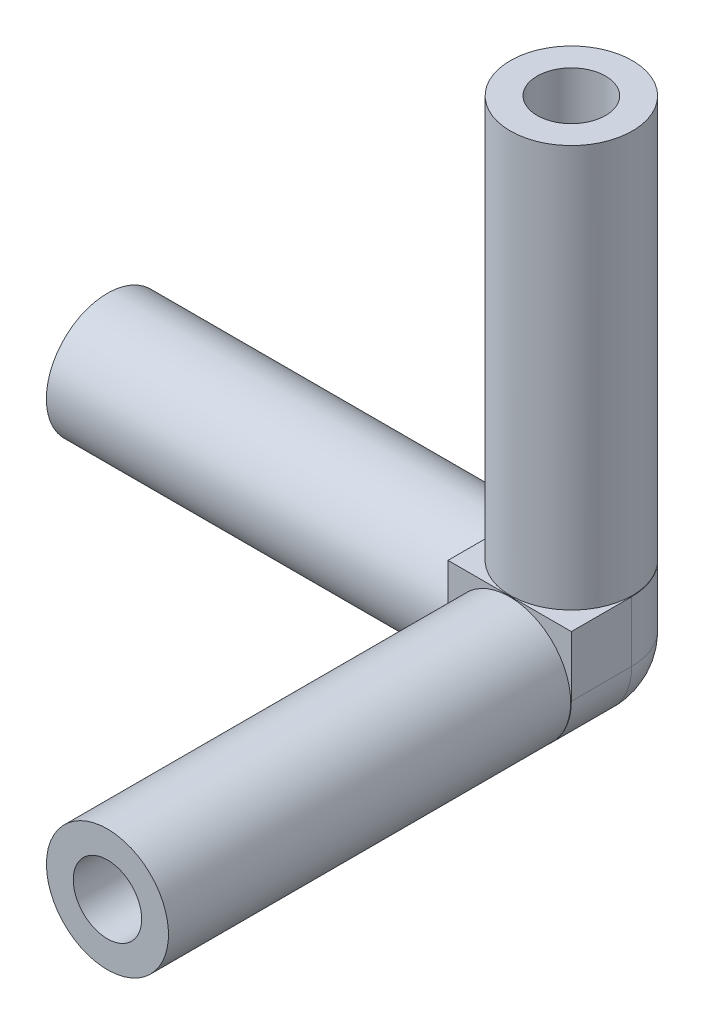
ISO-10303-21;
HEADER;
FILE_DESCRIPTION(('STEP AP214'),'2;1');
FILE_NAME('part.step','',(''),(''),'','','');
FILE_SCHEMA(('AUTOMOTIVE_DESIGN { 1 0 10303 214 1 1 1 1 }'));
ENDSEC;
DATA;
#1=APPLICATION_CONTEXT('core data for automotive mechanical design processes');
#2=APPLICATION_PROTOCOL_DEFINITION('international standard','automotive_design',2000,#1);
#3=PRODUCT_CONTEXT('',#1,'mechanical');
#4=PRODUCT('Part','Part','',(#3));
#5=PRODUCT_RELATED_PRODUCT_CATEGORY('part','',(#4));
#6=PRODUCT_DEFINITION_FORMATION('','',#4);
#7=PRODUCT_DEFINITION_CONTEXT('part definition',#1,'design');
#8=PRODUCT_DEFINITION('design','',#6,#7);
#9=PRODUCT_DEFINITION_SHAPE('','',#8);
#10=(LENGTH_UNIT() NAMED_UNIT(*) SI_UNIT(.MILLI.,.METRE.));
#11=(NAMED_UNIT(*) PLANE_ANGLE_UNIT() SI_UNIT($,.RADIAN.));
#12=(NAMED_UNIT(*) SI_UNIT($,.STERADIAN.) SOLID_ANGLE_UNIT());
#13=UNCERTAINTY_MEASURE_WITH_UNIT(LENGTH_MEASURE(1.E-05),#10,'distance_accuracy_value','');
#14=(GEOMETRIC_REPRESENTATION_CONTEXT(3) GLOBAL_UNCERTAINTY_ASSIGNED_CONTEXT((#13)) GLOBAL_UNIT_ASSIGNED_CONTEXT((#10,
#11,#12)) REPRESENTATION_CONTEXT('',''));
#15=CARTESIAN_POINT('',(0.,0.,0.));
#16=DIRECTION('',(0.,0.,1.));
#17=DIRECTION('',(1.,0.,0.));
#18=AXIS2_PLACEMENT_3D('',#15,#16,#17);
#19=CARTESIAN_POINT('',(140.733042235892,-0.400000000000003,-27.3342708358502));
#20=DIRECTION('',(-1.,0.,0.));
#21=DIRECTION('',(0.,0.,1.));
#22=AXIS2_PLACEMENT_3D('',#19,#20,#21);
#23=PLANE('',#22);
#24=CARTESIAN_POINT('',(140.733042235892,-4.4,-31.3342708358502));
#25=DIRECTION('',(-1.,0.,0.));
#26=DIRECTION('',(0.,0.,1.));
#27=AXIS2_PLACEMENT_3D('',#24,#25,#26);
#28=CIRCLE('',#27,2.55);
#29=CARTESIAN_POINT('',(140.733042235892,-4.4,-28.7842708358502));
#30=VERTEX_POINT('',#29);
#31=EDGE_CURVE('E13',#30,#30,#28,.T.);
#32=ORIENTED_EDGE('',*,*,#31,.T.);
#33=EDGE_LOOP('',(#32));
#34=FACE_BOUND('',#33,.T.);
#35=CARTESIAN_POINT('',(140.733042235892,-4.4,-31.3342708358502));
#36=DIRECTION('',(-1.,0.,0.));
#37=DIRECTION('',(0.,0.,1.));
#38=AXIS2_PLACEMENT_3D('',#35,#36,#37);
#39=CIRCLE('',#38,4.55);
#40=CARTESIAN_POINT('',(140.733042235892,-4.4,-26.7842708358502));
#41=VERTEX_POINT('',#40);
#42=EDGE_CURVE('E80',#41,#41,#39,.T.);
#43=ORIENTED_EDGE('',*,*,#42,.F.);
#44=EDGE_LOOP('',(#43));
#45=FACE_BOUND('',#44,.T.);
#46=ADVANCED_FACE('F65',(#34,#45),#23,.F.);
#47=CARTESIAN_POINT('',(110.733042235892,-4.4,-31.33427083585));
#48=DIRECTION('',(-1.,0.,0.));
#49=DIRECTION('',(0.,0.,1.));
#50=AXIS2_PLACEMENT_3D('',#47,#48,#49);
#51=PLANE('',#50);
#52=CARTESIAN_POINT('',(110.733042235892,-4.4,-31.33427083585));
#53=DIRECTION('',(-1.,0.,0.));
#54=DIRECTION('',(0.,0.,1.));
#55=AXIS2_PLACEMENT_3D('',#52,#53,#54);
#56=CIRCLE('',#55,4.55);
#57=CARTESIAN_POINT('',(110.733042235892,-4.4,-26.78427083585));
#58=VERTEX_POINT('',#57);
#59=EDGE_CURVE('E69',#58,#58,#56,.T.);
#60=ORIENTED_EDGE('',*,*,#59,.T.);
#61=EDGE_LOOP('',(#60));
#62=FACE_BOUND('',#61,.T.);
#63=CARTESIAN_POINT('',(110.733042235892,-4.4,-31.33427083585));
#64=DIRECTION('',(-1.,0.,0.));
#65=DIRECTION('',(0.,0.,1.));
#66=AXIS2_PLACEMENT_3D('',#63,#64,#65);
#67=CIRCLE('',#66,2.55);
#68=CARTESIAN_POINT('',(110.733042235892,-4.4,-28.78427083585));
#69=VERTEX_POINT('',#68);
#70=EDGE_CURVE('E74',#69,#69,#67,.T.);
#71=ORIENTED_EDGE('',*,*,#70,.F.);
#72=EDGE_LOOP('',(#71));
#73=FACE_BOUND('',#72,.T.);
#74=ADVANCED_FACE('F90',(#62,#73),#51,.T.);
#75=CARTESIAN_POINT('',(110.733042235892,-4.4,-31.33427083585));
#76=DIRECTION('',(1.,0.,0.));
#77=DIRECTION('',(0.,0.,-1.));
#78=AXIS2_PLACEMENT_3D('',#75,#76,#77);
#79=CYLINDRICAL_SURFACE('',#78,4.55);
#80=ORIENTED_EDGE('',*,*,#42,.T.);
#81=EDGE_LOOP('',(#80));
#82=FACE_BOUND('',#81,.T.);
#83=ORIENTED_EDGE('',*,*,#59,.F.);
#84=EDGE_LOOP('',(#83));
#85=FACE_BOUND('',#84,.T.);
#86=ADVANCED_FACE('F67',(#82,#85),#79,.T.);
#87=CARTESIAN_POINT('',(110.733042235892,-4.4,-31.33427083585));
#88=DIRECTION('',(1.,0.,0.));
#89=DIRECTION('',(0.,0.,-1.));
#90=AXIS2_PLACEMENT_3D('',#87,#88,#89);
#91=CYLINDRICAL_SURFACE('',#90,2.55);
#92=ORIENTED_EDGE('',*,*,#70,.T.);
#93=EDGE_LOOP('',(#92));
#94=FACE_BOUND('',#93,.T.);
#95=ORIENTED_EDGE('',*,*,#31,.F.);
#96=EDGE_LOOP('',(#95));
#97=FACE_BOUND('',#96,.T.);
#98=ADVANCED_FACE('F94',(#94,#97),#91,.F.);
#99=CLOSED_SHELL('',(#46,#74,#86,#98));
#100=MANIFOLD_SOLID_BREP('B2',#99);
#101=CARTESIAN_POINT('',(145.334550212783,30.203044431272,-31.3357331577452));
#102=DIRECTION('',(0.,-1.,4.60985232837495E-13));
#103=DIRECTION('',(0.,-4.60985232837495E-13,-1.));
#104=AXIS2_PLACEMENT_3D('',#101,#102,#103);
#105=CYLINDRICAL_SURFACE('',#104,4.55);
#106=CARTESIAN_POINT('',(145.334550212783,30.203044431272,-31.3357331577452));
#107=DIRECTION('',(0.,1.,-4.60985232837495E-13));
#108=DIRECTION('',(0.,4.60985232837495E-13,1.));
#109=AXIS2_PLACEMENT_3D('',#106,#107,#108);
#110=CIRCLE('',#109,4.55);
#111=CARTESIAN_POINT('',(145.334550212783,30.2030444312741,-26.7857331577452));
#112=VERTEX_POINT('',#111);
#113=EDGE_CURVE('E189',#112,#112,#110,.T.);
#114=ORIENTED_EDGE('',*,*,#113,.F.);
#115=EDGE_LOOP('',(#114));
#116=FACE_BOUND('',#115,.T.);
#117=CARTESIAN_POINT('',(145.334550212783,0.204443389159776,-31.3357331577314));
#118=DIRECTION('',(0.,1.,0.));
#119=DIRECTION('',(0.,0.,1.));
#120=AXIS2_PLACEMENT_3D('',#117,#118,#119);
#121=CIRCLE('',#120,4.55);
#122=CARTESIAN_POINT('',(145.452700054024,0.204443389159776,-26.7872674147566));
#123=VERTEX_POINT('',#122);
#124=CARTESIAN_POINT('',(149.884550206818,0.204443389159776,-31.3355001625663));
#125=VERTEX_POINT('',#124);
#126=EDGE_CURVE('E184',#123,#125,#121,.T.);
#127=ORIENTED_EDGE('',*,*,#126,.T.);
#128=CARTESIAN_POINT('',(145.334550212783,0.204443389159776,-31.3357331577314));
#129=DIRECTION('',(0.,1.,0.));
#130=DIRECTION('',(0.,0.,1.));
#131=AXIS2_PLACEMENT_3D('',#128,#129,#130);
#132=CIRCLE('',#131,4.55);
#133=CARTESIAN_POINT('',(145.457571658612,0.204443389159776,-35.8840697464049));
#134=VERTEX_POINT('',#133);
#135=EDGE_CURVE('E152',#125,#134,#132,.T.);
#136=ORIENTED_EDGE('',*,*,#135,.T.);
#137=CARTESIAN_POINT('',(145.334550212783,0.204443389159776,-31.3357331577314));
#138=DIRECTION('',(0.,1.,0.));
#139=DIRECTION('',(0.,0.,1.));
#140=AXIS2_PLACEMENT_3D('',#137,#138,#139);
#141=CIRCLE('',#140,4.55);
#142=CARTESIAN_POINT('',(145.210578277765,0.204443389159776,-35.8840439385958));
#143=VERTEX_POINT('',#142);
#144=EDGE_CURVE('E179',#134,#143,#141,.T.);
#145=ORIENTED_EDGE('',*,*,#144,.T.);
#146=CARTESIAN_POINT('',(145.334550212783,0.204443389159776,-31.3357331577314));
#147=DIRECTION('',(0.,1.,0.));
#148=DIRECTION('',(0.,0.,1.));
#149=AXIS2_PLACEMENT_3D('',#146,#147,#148);
#150=CIRCLE('',#149,4.55);
#151=CARTESIAN_POINT('',(140.78455031134,0.204443389159776,-31.3347861287464));
#152=VERTEX_POINT('',#151);
#153=EDGE_CURVE('E197',#143,#152,#150,.T.);
#154=ORIENTED_EDGE('',*,*,#153,.T.);
#155=CARTESIAN_POINT('',(145.334550212783,0.204443389159776,-31.3357331577314));
#156=DIRECTION('',(0.,1.,0.));
#157=DIRECTION('',(0.,0.,1.));
#158=AXIS2_PLACEMENT_3D('',#155,#156,#157);
#159=CIRCLE('',#158,4.55);
#160=CARTESIAN_POINT('',(145.212136715868,0.204443389159776,-26.787380166178));
#161=VERTEX_POINT('',#160);
#162=EDGE_CURVE('E192',#152,#161,#159,.T.);
#163=ORIENTED_EDGE('',*,*,#162,.T.);
#164=CARTESIAN_POINT('',(145.334550212783,0.204443389159776,-31.3357331577314));
#165=DIRECTION('',(0.,1.,0.));
#166=DIRECTION('',(0.,0.,1.));
#167=AXIS2_PLACEMENT_3D('',#164,#165,#166);
#168=CIRCLE('',#167,4.55);
#169=CARTESIAN_POINT('',(145.332414123907,0.204443389159776,-26.7857336591463));
#170=VERTEX_POINT('',#169);
#171=EDGE_CURVE('E158',#170,#161,#168,.F.);
#172=ORIENTED_EDGE('',*,*,#171,.F.);
#173=CARTESIAN_POINT('',(145.334550212783,0.204443389159776,-31.3357331577314));
#174=DIRECTION('',(0.,1.,0.));
#175=DIRECTION('',(0.,0.,1.));
#176=AXIS2_PLACEMENT_3D('',#173,#174,#175);
#177=CIRCLE('',#176,4.55);
#178=EDGE_CURVE('E186',#123,#170,#177,.F.);
#179=ORIENTED_EDGE('',*,*,#178,.F.);
#180=EDGE_LOOP('',(#127,#136,#145,#154,#163,#172,#179));
#181=FACE_BOUND('',#180,.T.);
#182=ADVANCED_FACE('F149',(#116,#181),#105,.T.);
#183=CARTESIAN_POINT('',(145.334550212783,30.203044431272,-31.3357331577452));
#184=DIRECTION('',(0.,1.,-4.60985232837495E-13));
#185=DIRECTION('',(0.,4.60985232837495E-13,1.));
#186=AXIS2_PLACEMENT_3D('',#183,#184,#185);
#187=PLANE('',#186);
#188=ORIENTED_EDGE('',*,*,#113,.T.);
#189=EDGE_LOOP('',(#188));
#190=FACE_BOUND('',#189,.T.);
#191=CARTESIAN_POINT('',(145.334550212783,30.203044431272,-31.3357331577452));
#192=DIRECTION('',(0.,1.,-4.60985232837495E-13));
#193=DIRECTION('',(0.,4.60985232837495E-13,1.));
#194=AXIS2_PLACEMENT_3D('',#191,#192,#193);
#195=CIRCLE('',#194,2.55);
#196=CARTESIAN_POINT('',(145.334550212783,30.2030444312732,-28.7857331577452));
#197=VERTEX_POINT('',#196);
#198=EDGE_CURVE('E198',#197,#197,#195,.T.);
#199=ORIENTED_EDGE('',*,*,#198,.F.);
#200=EDGE_LOOP('',(#199));
#201=FACE_BOUND('',#200,.T.);
#202=ADVANCED_FACE('F207',(#190,#201),#187,.T.);
#203=CARTESIAN_POINT('',(145.334550212783,30.203044431272,-31.3357331577452));
#204=DIRECTION('',(0.,-1.,4.60985232837495E-13));
#205=DIRECTION('',(0.,-4.60985232837495E-13,-1.));
#206=AXIS2_PLACEMENT_3D('',#203,#204,#205);
#207=CYLINDRICAL_SURFACE('',#206,2.55);
#208=ORIENTED_EDGE('',*,*,#198,.T.);
#209=EDGE_LOOP('',(#208));
#210=FACE_BOUND('',#209,.T.);
#211=CARTESIAN_POINT('',(145.334550212783,0.204443389159772,-31.3357331577314));
#212=DIRECTION('',(0.,1.,0.));
#213=DIRECTION('',(0.,0.,1.));
#214=AXIS2_PLACEMENT_3D('',#211,#212,#213);
#215=CIRCLE('',#214,2.55);
#216=CARTESIAN_POINT('',(145.334550212783,0.204443389159772,-28.7857331577314));
#217=VERTEX_POINT('',#216);
#218=EDGE_CURVE('E63',#217,#217,#215,.T.);
#219=ORIENTED_EDGE('',*,*,#218,.F.);
#220=EDGE_LOOP('',(#219));
#221=FACE_BOUND('',#220,.T.);
#222=ADVANCED_FACE('F213',(#210,#221),#207,.F.);
#223=CARTESIAN_POINT('',(141.334550212783,0.204443389159776,-27.3342708358502));
#224=DIRECTION('',(0.,1.,0.));
#225=DIRECTION('',(0.,0.,1.));
#226=AXIS2_PLACEMENT_3D('',#223,#224,#225);
#227=PLANE('',#226);
#228=ORIENTED_EDGE('',*,*,#218,.T.);
#229=EDGE_LOOP('',(#228));
#230=FACE_BOUND('',#229,.T.);
#231=ORIENTED_EDGE('',*,*,#178,.T.);
#232=ORIENTED_EDGE('',*,*,#171,.T.);
#233=ORIENTED_EDGE('',*,*,#162,.F.);
#234=ORIENTED_EDGE('',*,*,#153,.F.);
#235=ORIENTED_EDGE('',*,*,#144,.F.);
#236=ORIENTED_EDGE('',*,*,#135,.F.);
#237=ORIENTED_EDGE('',*,*,#126,.F.);
#238=EDGE_LOOP('',(#231,#232,#233,#234,#235,#236,#237));
#239=FACE_BOUND('',#238,.T.);
#240=ADVANCED_FACE('F187',(#230,#239),#227,.F.);
#241=CLOSED_SHELL('',(#182,#202,#222,#240));
#242=MANIFOLD_SOLID_BREP('B8',#241);
#243=CARTESIAN_POINT('',(145.332674585782,-4.4,-26.741405825508));
#244=DIRECTION('',(1.21604012262315E-12,0.,1.));
#245=DIRECTION('',(1.,0.,-1.21604012262315E-12));
#246=AXIS2_PLACEMENT_3D('',#243,#244,#245);
#247=CYLINDRICAL_SURFACE('',#246,4.55);
#248=CARTESIAN_POINT('',(145.332674585819,-4.4,3.25859417449202));
#249=DIRECTION('',(-1.21604012262315E-12,0.,-1.));
#250=DIRECTION('',(-1.,0.,1.21604012262315E-12));
#251=AXIS2_PLACEMENT_3D('',#248,#249,#250);
#252=CIRCLE('',#251,4.55);
#253=CARTESIAN_POINT('',(140.782674585819,-4.4,3.25859417449755));
#254=VERTEX_POINT('',#253);
#255=EDGE_CURVE('E302',#254,#254,#252,.T.);
#256=ORIENTED_EDGE('',*,*,#255,.T.);
#257=EDGE_LOOP('',(#256));
#258=FACE_BOUND('',#257,.T.);
#259=CARTESIAN_POINT('',(145.332674585782,-4.4,-26.7375430442746));
#260=DIRECTION('',(0.,0.,1.));
#261=DIRECTION('',(1.,0.,0.));
#262=AXIS2_PLACEMENT_3D('',#259,#260,#261);
#263=CIRCLE('',#262,4.55);
#264=CARTESIAN_POINT('',(140.7848081089,-4.26067839920369,-26.7375430442745));
#265=VERTEX_POINT('',#264);
#266=CARTESIAN_POINT('',(140.782674585782,-4.4,-26.7375430442745));
#267=VERTEX_POINT('',#266);
#268=EDGE_CURVE('E296',#265,#267,#263,.T.);
#269=ORIENTED_EDGE('',*,*,#268,.T.);
#270=CARTESIAN_POINT('',(145.332674585782,-4.4,-26.7375430442746));
#271=DIRECTION('',(0.,0.,1.));
#272=DIRECTION('',(1.,0.,0.));
#273=AXIS2_PLACEMENT_3D('',#270,#271,#272);
#274=CIRCLE('',#273,4.55);
#275=CARTESIAN_POINT('',(140.784808143108,-4.5393227174553,-26.7375430442745));
#276=VERTEX_POINT('',#275);
#277=EDGE_CURVE('E264',#267,#276,#274,.T.);
#278=ORIENTED_EDGE('',*,*,#277,.T.);
#279=CARTESIAN_POINT('',(145.332674585782,-4.4,-26.7375430442746));
#280=DIRECTION('',(0.,0.,1.));
#281=DIRECTION('',(1.,0.,0.));
#282=AXIS2_PLACEMENT_3D('',#279,#280,#281);
#283=CIRCLE('',#282,4.55);
#284=CARTESIAN_POINT('',(145.330901021153,-8.94999965433719,-26.7375430442746));
#285=VERTEX_POINT('',#284);
#286=EDGE_CURVE('E300',#285,#276,#283,.F.);
#287=ORIENTED_EDGE('',*,*,#286,.F.);
#288=CARTESIAN_POINT('',(145.332674585782,-4.4,-26.7375430442746));
#289=DIRECTION('',(0.,0.,1.));
#290=DIRECTION('',(1.,0.,0.));
#291=AXIS2_PLACEMENT_3D('',#288,#289,#290);
#292=CIRCLE('',#291,4.55);
#293=CARTESIAN_POINT('',(149.882674499593,-4.40088562146222,-26.7375430442746));
#294=VERTEX_POINT('',#293);
#295=EDGE_CURVE('E270',#294,#285,#292,.F.);
#296=ORIENTED_EDGE('',*,*,#295,.F.);
#297=CARTESIAN_POINT('',(145.332674585782,-4.4,-26.7375430442746));
#298=DIRECTION('',(0.,0.,1.));
#299=DIRECTION('',(1.,0.,0.));
#300=AXIS2_PLACEMENT_3D('',#297,#298,#299);
#301=CIRCLE('',#300,4.55);
#302=CARTESIAN_POINT('',(145.452943054744,0.148410216259485,-26.7375430442746));
#303=VERTEX_POINT('',#302);
#304=EDGE_CURVE('E312',#303,#294,#301,.F.);
#305=ORIENTED_EDGE('',*,*,#304,.F.);
#306=CARTESIAN_POINT('',(145.332674585782,-4.4,-26.7375430442746));
#307=DIRECTION('',(0.,0.,1.));
#308=DIRECTION('',(1.,0.,0.));
#309=AXIS2_PLACEMENT_3D('',#306,#307,#308);
#310=CIRCLE('',#309,4.55);
#311=CARTESIAN_POINT('',(145.332672663115,0.149999999999594,-26.7375430442746));
#312=VERTEX_POINT('',#311);
#313=EDGE_CURVE('E315',#312,#303,#310,.F.);
#314=ORIENTED_EDGE('',*,*,#313,.F.);
#315=CARTESIAN_POINT('',(145.332674585782,-4.4,-26.7375430442746));
#316=DIRECTION('',(0.,0.,1.));
#317=DIRECTION('',(1.,0.,0.));
#318=AXIS2_PLACEMENT_3D('',#315,#316,#317);
#319=CIRCLE('',#318,4.55);
#320=CARTESIAN_POINT('',(145.212407790489,0.148410260514103,-26.7375430442746));
#321=VERTEX_POINT('',#320);
#322=EDGE_CURVE('E313',#321,#312,#319,.F.);
#323=ORIENTED_EDGE('',*,*,#322,.F.);
#324=CARTESIAN_POINT('',(145.332674585782,-4.4,-26.7375430442746));
#325=DIRECTION('',(0.,0.,1.));
#326=DIRECTION('',(1.,0.,0.));
#327=AXIS2_PLACEMENT_3D('',#324,#325,#326);
#328=CIRCLE('',#327,4.55);
#329=EDGE_CURVE('E304',#265,#321,#328,.F.);
#330=ORIENTED_EDGE('',*,*,#329,.F.);
#331=EDGE_LOOP('',(#269,#278,#287,#296,#305,#314,#323,#330));
#332=FACE_BOUND('',#331,.T.);
#333=ADVANCED_FACE('F261',(#258,#332),#247,.T.);
#334=CARTESIAN_POINT('',(145.332674585819,-4.4,3.25859417449202));
#335=DIRECTION('',(-1.21604012262315E-12,0.,-1.));
#336=DIRECTION('',(-1.,0.,1.21604012262315E-12));
#337=AXIS2_PLACEMENT_3D('',#334,#335,#336);
#338=PLANE('',#337);
#339=ORIENTED_EDGE('',*,*,#255,.F.);
#340=EDGE_LOOP('',(#339));
#341=FACE_BOUND('',#340,.T.);
#342=CARTESIAN_POINT('',(145.332674585819,-4.4,3.25859417449202));
#343=DIRECTION('',(-1.21604012262315E-12,0.,-1.));
#344=DIRECTION('',(-1.,0.,1.21604012262315E-12));
#345=AXIS2_PLACEMENT_3D('',#342,#343,#344);
#346=CIRCLE('',#345,2.55);
#347=CARTESIAN_POINT('',(142.782674585819,-4.4,3.25859417449512));
#348=VERTEX_POINT('',#347);
#349=EDGE_CURVE('E305',#348,#348,#346,.T.);
#350=ORIENTED_EDGE('',*,*,#349,.T.);
#351=EDGE_LOOP('',(#350));
#352=FACE_BOUND('',#351,.T.);
#353=ADVANCED_FACE('F324',(#341,#352),#338,.F.);
#354=CARTESIAN_POINT('',(145.332674585782,-4.4,-26.741405825508));
#355=DIRECTION('',(1.21604012262315E-12,0.,1.));
#356=DIRECTION('',(1.,0.,-1.21604012262315E-12));
#357=AXIS2_PLACEMENT_3D('',#354,#355,#356);
#358=CYLINDRICAL_SURFACE('',#357,2.55);
#359=CARTESIAN_POINT('',(145.332674585782,-4.4,-26.7375430442746));
#360=DIRECTION('',(0.,0.,1.));
#361=DIRECTION('',(1.,0.,0.));
#362=AXIS2_PLACEMENT_3D('',#359,#360,#361);
#363=CIRCLE('',#362,2.55);
#364=CARTESIAN_POINT('',(147.882674585782,-4.4,-26.7375430442746));
#365=VERTEX_POINT('',#364);
#366=EDGE_CURVE('E147',#365,#365,#363,.F.);
#367=ORIENTED_EDGE('',*,*,#366,.T.);
#368=EDGE_LOOP('',(#367));
#369=FACE_BOUND('',#368,.T.);
#370=ORIENTED_EDGE('',*,*,#349,.F.);
#371=EDGE_LOOP('',(#370));
#372=FACE_BOUND('',#371,.T.);
#373=ADVANCED_FACE('F327',(#369,#372),#358,.F.);
#374=CARTESIAN_POINT('',(141.334550212783,-0.400000000000003,-26.7375430442745));
#375=DIRECTION('',(0.,0.,1.));
#376=DIRECTION('',(1.,0.,0.));
#377=AXIS2_PLACEMENT_3D('',#374,#375,#376);
#378=PLANE('',#377);
#379=ORIENTED_EDGE('',*,*,#366,.F.);
#380=EDGE_LOOP('',(#379));
#381=FACE_BOUND('',#380,.T.);
#382=ORIENTED_EDGE('',*,*,#295,.T.);
#383=ORIENTED_EDGE('',*,*,#286,.T.);
#384=ORIENTED_EDGE('',*,*,#277,.F.);
#385=ORIENTED_EDGE('',*,*,#268,.F.);
#386=ORIENTED_EDGE('',*,*,#329,.T.);
#387=ORIENTED_EDGE('',*,*,#322,.T.);
#388=ORIENTED_EDGE('',*,*,#313,.T.);
#389=ORIENTED_EDGE('',*,*,#304,.T.);
#390=EDGE_LOOP('',(#382,#383,#384,#385,#386,#387,#388,#389));
#391=FACE_BOUND('',#390,.T.);
#392=ADVANCED_FACE('F299',(#381,#391),#378,.F.);
#393=CLOSED_SHELL('',(#333,#353,#373,#392));
#394=MANIFOLD_SOLID_BREP('B57',#393);
#395=CARTESIAN_POINT('',(140.734550212783,-9.,-35.9342708358502));
#396=DIRECTION('',(-1.,0.,0.));
#397=DIRECTION('',(0.,-1.,0.));
#398=AXIS2_PLACEMENT_3D('',#395,#396,#397);
#399=PLANE('',#398);
#400=DIRECTION('',(0.,1.,0.));
#401=VECTOR('',#400,1.);
#402=CARTESIAN_POINT('',(140.734550212783,-9.,-35.9342708358502));
#403=LINE('',#402,#401);
#404=CARTESIAN_POINT('',(140.734550212783,-4.3,-35.9342708358502));
#405=VERTEX_POINT('',#404);
#406=CARTESIAN_POINT('',(140.734550212783,0.199999999999998,-35.9342708358502));
#407=VERTEX_POINT('',#406);
#408=EDGE_CURVE('E451',#405,#407,#403,.T.);
#409=ORIENTED_EDGE('',*,*,#408,.F.);
#410=CARTESIAN_POINT('',(140.734550212783,-4.3,-31.2342708358502));
#411=DIRECTION('',(-1.,0.,0.));
#412=DIRECTION('',(0.,-1.,0.));
#413=AXIS2_PLACEMENT_3D('',#410,#411,#412);
#414=CIRCLE('',#413,4.7);
#415=CARTESIAN_POINT('',(140.734550212783,-9.,-31.2342708358502));
#416=VERTEX_POINT('',#415);
#417=EDGE_CURVE('E428',#405,#416,#414,.T.);
#418=ORIENTED_EDGE('',*,*,#417,.T.);
#419=DIRECTION('',(0.,0.,1.));
#420=VECTOR('',#419,1.);
#421=CARTESIAN_POINT('',(140.734550212783,-9.,-35.9342708358502));
#422=LINE('',#421,#420);
#423=CARTESIAN_POINT('',(140.734550212783,-9.,-26.7342708358503));
#424=VERTEX_POINT('',#423);
#425=EDGE_CURVE('E421',#416,#424,#422,.T.);
#426=ORIENTED_EDGE('',*,*,#425,.T.);
#427=DIRECTION('',(0.,1.,0.));
#428=VECTOR('',#427,1.);
#429=CARTESIAN_POINT('',(140.734550212783,-9.,-26.7342708358503));
#430=LINE('',#429,#428);
#431=CARTESIAN_POINT('',(140.734550212783,0.199999999999996,-26.7342708358503));
#432=VERTEX_POINT('',#431);
#433=EDGE_CURVE('E425',#424,#432,#430,.T.);
#434=ORIENTED_EDGE('',*,*,#433,.T.);
#435=DIRECTION('',(0.,0.,1.));
#436=VECTOR('',#435,1.);
#437=CARTESIAN_POINT('',(140.734550212783,0.199999999999998,-35.9342708358502));
#438=LINE('',#437,#436);
#439=EDGE_CURVE('E443',#407,#432,#438,.T.);
#440=ORIENTED_EDGE('',*,*,#439,.F.);
#441=EDGE_LOOP('',(#409,#418,#426,#434,#440));
#442=FACE_BOUND('',#441,.T.);
#443=ADVANCED_FACE('F367',(#442),#399,.T.);
#444=CARTESIAN_POINT('',(140.734550212783,-9.,-35.9342708358502));
#445=DIRECTION('',(0.,0.,-1.));
#446=DIRECTION('',(0.,1.,0.));
#447=AXIS2_PLACEMENT_3D('',#444,#445,#446);
#448=PLANE('',#447);
#449=DIRECTION('',(-1.,0.,0.));
#450=VECTOR('',#449,1.);
#451=CARTESIAN_POINT('',(140.734550212783,0.199999999999998,-35.9342708358502));
#452=LINE('',#451,#450);
#453=CARTESIAN_POINT('',(145.234550212783,0.199999999999998,-35.9342708358502));
#454=VERTEX_POINT('',#453);
#455=EDGE_CURVE('E430',#454,#407,#452,.T.);
#456=ORIENTED_EDGE('',*,*,#455,.F.);
#457=DIRECTION('',(0.,1.,0.));
#458=VECTOR('',#457,1.);
#459=CARTESIAN_POINT('',(145.234550212783,-9.,-35.9342708358502));
#460=LINE('',#459,#458);
#461=CARTESIAN_POINT('',(145.234550212783,-4.3,-35.9342708358502));
#462=VERTEX_POINT('',#461);
#463=EDGE_CURVE('E463',#454,#462,#460,.F.);
#464=ORIENTED_EDGE('',*,*,#463,.T.);
#465=DIRECTION('',(-1.,0.,0.));
#466=VECTOR('',#465,1.);
#467=CARTESIAN_POINT('',(140.734550212783,-4.3,-35.9342708358502));
#468=LINE('',#467,#466);
#469=EDGE_CURVE('E461',#462,#405,#468,.T.);
#470=ORIENTED_EDGE('',*,*,#469,.T.);
#471=ORIENTED_EDGE('',*,*,#408,.T.);
#472=EDGE_LOOP('',(#456,#464,#470,#471));
#473=FACE_BOUND('',#472,.T.);
#474=ADVANCED_FACE('F493',(#473),#448,.T.);
#475=CARTESIAN_POINT('',(149.934550212783,-9.,-35.9342708358502));
#476=DIRECTION('',(1.,0.,0.));
#477=DIRECTION('',(0.,1.,0.));
#478=AXIS2_PLACEMENT_3D('',#475,#476,#477);
#479=PLANE('',#478);
#480=DIRECTION('',(0.,0.,-1.));
#481=VECTOR('',#480,1.);
#482=CARTESIAN_POINT('',(149.934550212783,-4.3,-35.9342708358502));
#483=LINE('',#482,#481);
#484=CARTESIAN_POINT('',(149.934550212783,-4.3,-26.7342708358503));
#485=VERTEX_POINT('',#484);
#486=CARTESIAN_POINT('',(149.934550212783,-4.3,-31.2342708358502));
#487=VERTEX_POINT('',#486);
#488=EDGE_CURVE('E453',#485,#487,#483,.T.);
#489=ORIENTED_EDGE('',*,*,#488,.T.);
#490=DIRECTION('',(0.,1.,0.));
#491=VECTOR('',#490,1.);
#492=CARTESIAN_POINT('',(149.934550212783,-9.,-31.2342708358502));
#493=LINE('',#492,#491);
#494=CARTESIAN_POINT('',(149.934550212783,0.199999999999997,-31.2342708358502));
#495=VERTEX_POINT('',#494);
#496=EDGE_CURVE('E456',#487,#495,#493,.T.);
#497=ORIENTED_EDGE('',*,*,#496,.T.);
#498=DIRECTION('',(0.,0.,-1.));
#499=VECTOR('',#498,1.);
#500=CARTESIAN_POINT('',(149.934550212783,0.199999999999998,-35.9342708358502));
#501=LINE('',#500,#499);
#502=CARTESIAN_POINT('',(149.934550212783,0.199999999999996,-26.7342708358503));
#503=VERTEX_POINT('',#502);
#504=EDGE_CURVE('E446',#503,#495,#501,.T.);
#505=ORIENTED_EDGE('',*,*,#504,.F.);
#506=DIRECTION('',(0.,1.,0.));
#507=VECTOR('',#506,1.);
#508=CARTESIAN_POINT('',(149.934550212783,-9.,-26.7342708358503));
#509=LINE('',#508,#507);
#510=EDGE_CURVE('E438',#485,#503,#509,.T.);
#511=ORIENTED_EDGE('',*,*,#510,.F.);
#512=EDGE_LOOP('',(#489,#497,#505,#511));
#513=FACE_BOUND('',#512,.T.);
#514=ADVANCED_FACE('F486',(#513),#479,.T.);
#515=CARTESIAN_POINT('',(140.734550212783,-9.,-26.7342708358503));
#516=DIRECTION('',(0.,0.,1.));
#517=DIRECTION('',(0.,-1.,0.));
#518=AXIS2_PLACEMENT_3D('',#515,#516,#517);
#519=PLANE('',#518);
#520=DIRECTION('',(1.,0.,0.));
#521=VECTOR('',#520,1.);
#522=CARTESIAN_POINT('',(140.734550212783,-9.,-26.7342708358503));
#523=LINE('',#522,#521);
#524=CARTESIAN_POINT('',(145.234550212783,-9.,-26.7342708358503));
#525=VERTEX_POINT('',#524);
#526=EDGE_CURVE('E429',#424,#525,#523,.T.);
#527=ORIENTED_EDGE('',*,*,#526,.T.);
#528=CARTESIAN_POINT('',(145.234550212783,-4.3,-26.7342708358503));
#529=DIRECTION('',(0.,0.,1.));
#530=DIRECTION('',(0.,-1.,0.));
#531=AXIS2_PLACEMENT_3D('',#528,#529,#530);
#532=CIRCLE('',#531,4.7);
#533=EDGE_CURVE('E259',#525,#485,#532,.T.);
#534=ORIENTED_EDGE('',*,*,#533,.T.);
#535=ORIENTED_EDGE('',*,*,#510,.T.);
#536=DIRECTION('',(1.,0.,0.));
#537=VECTOR('',#536,1.);
#538=CARTESIAN_POINT('',(140.734550212783,0.199999999999996,-26.7342708358503));
#539=LINE('',#538,#537);
#540=EDGE_CURVE('E436',#432,#503,#539,.T.);
#541=ORIENTED_EDGE('',*,*,#540,.F.);
#542=ORIENTED_EDGE('',*,*,#433,.F.);
#543=EDGE_LOOP('',(#527,#534,#535,#541,#542));
#544=FACE_BOUND('',#543,.T.);
#545=ADVANCED_FACE('F433',(#544),#519,.T.);
#546=CARTESIAN_POINT('',(0.,-9.00000000000001,0.));
#547=DIRECTION('',(0.,1.,0.));
#548=DIRECTION('',(0.,0.,1.));
#549=AXIS2_PLACEMENT_3D('',#546,#547,#548);
#550=PLANE('',#549);
#551=ORIENTED_EDGE('',*,*,#425,.F.);
#552=DIRECTION('',(-1.,0.,0.));
#553=VECTOR('',#552,1.);
#554=CARTESIAN_POINT('',(149.934550212783,-9.,-31.2342708358502));
#555=LINE('',#554,#553);
#556=CARTESIAN_POINT('',(145.234550212783,-9.,-31.2342708358502));
#557=VERTEX_POINT('',#556);
#558=EDGE_CURVE('E376',#416,#557,#555,.F.);
#559=ORIENTED_EDGE('',*,*,#558,.T.);
#560=DIRECTION('',(0.,0.,-1.));
#561=VECTOR('',#560,1.);
#562=CARTESIAN_POINT('',(145.234550212783,-9.00000000000001,-26.7342708358503));
#563=LINE('',#562,#561);
#564=EDGE_CURVE('E387',#557,#525,#563,.F.);
#565=ORIENTED_EDGE('',*,*,#564,.T.);
#566=ORIENTED_EDGE('',*,*,#526,.F.);
#567=EDGE_LOOP('',(#551,#559,#565,#566));
#568=FACE_BOUND('',#567,.T.);
#569=ADVANCED_FACE('F440',(#568),#550,.F.);
#570=CARTESIAN_POINT('',(0.,0.199999999999993,0.));
#571=DIRECTION('',(0.,1.,0.));
#572=DIRECTION('',(0.,0.,1.));
#573=AXIS2_PLACEMENT_3D('',#570,#571,#572);
#574=PLANE('',#573);
#575=ORIENTED_EDGE('',*,*,#504,.T.);
#576=CARTESIAN_POINT('',(145.234550212783,0.199999999999997,-31.2342708358502));
#577=DIRECTION('',(0.,1.,0.));
#578=DIRECTION('',(0.,0.,1.));
#579=AXIS2_PLACEMENT_3D('',#576,#577,#578);
#580=CIRCLE('',#579,4.7);
#581=EDGE_CURVE('E459',#495,#454,#580,.T.);
#582=ORIENTED_EDGE('',*,*,#581,.T.);
#583=ORIENTED_EDGE('',*,*,#455,.T.);
#584=ORIENTED_EDGE('',*,*,#439,.T.);
#585=ORIENTED_EDGE('',*,*,#540,.T.);
#586=EDGE_LOOP('',(#575,#582,#583,#584,#585));
#587=FACE_BOUND('',#586,.T.);
#588=ADVANCED_FACE('F490',(#587),#574,.T.);
#589=CARTESIAN_POINT('',(140.734550212783,-4.3,-31.2342708358502));
#590=DIRECTION('',(1.,0.,0.));
#591=DIRECTION('',(0.,0.,-1.));
#592=AXIS2_PLACEMENT_3D('',#589,#590,#591);
#593=CYLINDRICAL_SURFACE('',#592,4.7);
#594=ORIENTED_EDGE('',*,*,#417,.F.);
#595=ORIENTED_EDGE('',*,*,#469,.F.);
#596=CARTESIAN_POINT('',(145.234550212783,-4.3,-31.2342708358502));
#597=DIRECTION('',(1.,0.,0.));
#598=DIRECTION('',(0.,0.,-1.));
#599=AXIS2_PLACEMENT_3D('',#596,#597,#598);
#600=CIRCLE('',#599,4.7);
#601=EDGE_CURVE('E371',#557,#462,#600,.T.);
#602=ORIENTED_EDGE('',*,*,#601,.F.);
#603=ORIENTED_EDGE('',*,*,#558,.F.);
#604=EDGE_LOOP('',(#594,#595,#602,#603));
#605=FACE_BOUND('',#604,.T.);
#606=ADVANCED_FACE('F369',(#605),#593,.T.);
#607=CARTESIAN_POINT('',(145.234550212783,-4.3,-35.9342708358502));
#608=DIRECTION('',(0.,0.,1.));
#609=DIRECTION('',(0.,-1.,0.));
#610=AXIS2_PLACEMENT_3D('',#607,#608,#609);
#611=CYLINDRICAL_SURFACE('',#610,4.7);
#612=ORIENTED_EDGE('',*,*,#533,.F.);
#613=ORIENTED_EDGE('',*,*,#564,.F.);
#614=CARTESIAN_POINT('',(145.234550212783,-4.3,-31.2342708358502));
#615=DIRECTION('',(0.,0.,-1.));
#616=DIRECTION('',(-1.,0.,0.));
#617=AXIS2_PLACEMENT_3D('',#614,#615,#616);
#618=CIRCLE('',#617,4.7);
#619=EDGE_CURVE('E470',#487,#557,#618,.T.);
#620=ORIENTED_EDGE('',*,*,#619,.F.);
#621=ORIENTED_EDGE('',*,*,#488,.F.);
#622=EDGE_LOOP('',(#612,#613,#620,#621));
#623=FACE_BOUND('',#622,.T.);
#624=ADVANCED_FACE('F510',(#623),#611,.T.);
#625=CARTESIAN_POINT('',(145.234550212783,-4.3,-31.2342708358502));
#626=DIRECTION('',(0.,-1.,0.));
#627=DIRECTION('',(0.,0.,-1.));
#628=AXIS2_PLACEMENT_3D('',#625,#626,#627);
#629=SPHERICAL_SURFACE('',#628,4.7);
#630=ORIENTED_EDGE('',*,*,#619,.T.);
#631=ORIENTED_EDGE('',*,*,#601,.T.);
#632=CARTESIAN_POINT('',(145.234550212783,-4.3,-31.2342708358502));
#633=DIRECTION('',(0.,-1.,0.));
#634=DIRECTION('',(0.,0.,-1.));
#635=AXIS2_PLACEMENT_3D('',#632,#633,#634);
#636=CIRCLE('',#635,4.7);
#637=EDGE_CURVE('E468',#487,#462,#636,.F.);
#638=ORIENTED_EDGE('',*,*,#637,.F.);
#639=EDGE_LOOP('',(#630,#631,#638));
#640=FACE_BOUND('',#639,.T.);
#641=ADVANCED_FACE('F477',(#640),#629,.T.);
#642=CARTESIAN_POINT('',(145.234550212783,-9.,-31.2342708358502));
#643=DIRECTION('',(0.,1.,0.));
#644=DIRECTION('',(0.,0.,1.));
#645=AXIS2_PLACEMENT_3D('',#642,#643,#644);
#646=CYLINDRICAL_SURFACE('',#645,4.7);
#647=ORIENTED_EDGE('',*,*,#637,.T.);
#648=ORIENTED_EDGE('',*,*,#463,.F.);
#649=ORIENTED_EDGE('',*,*,#581,.F.);
#650=ORIENTED_EDGE('',*,*,#496,.F.);
#651=EDGE_LOOP('',(#647,#648,#649,#650));
#652=FACE_BOUND('',#651,.T.);
#653=ADVANCED_FACE('F483',(#652),#646,.T.);
#654=CLOSED_SHELL('',(#443,#474,#514,#545,#569,#588,#606,#624,#641,#653));
#655=MANIFOLD_SOLID_BREP('B141',#654);
#656=ADVANCED_BREP_SHAPE_REPRESENTATION('',(#18,#100,#242,#394,#655),#14);
#657=SHAPE_DEFINITION_REPRESENTATION(#9,#656);
ENDSEC;
END-ISO-10303-21;
